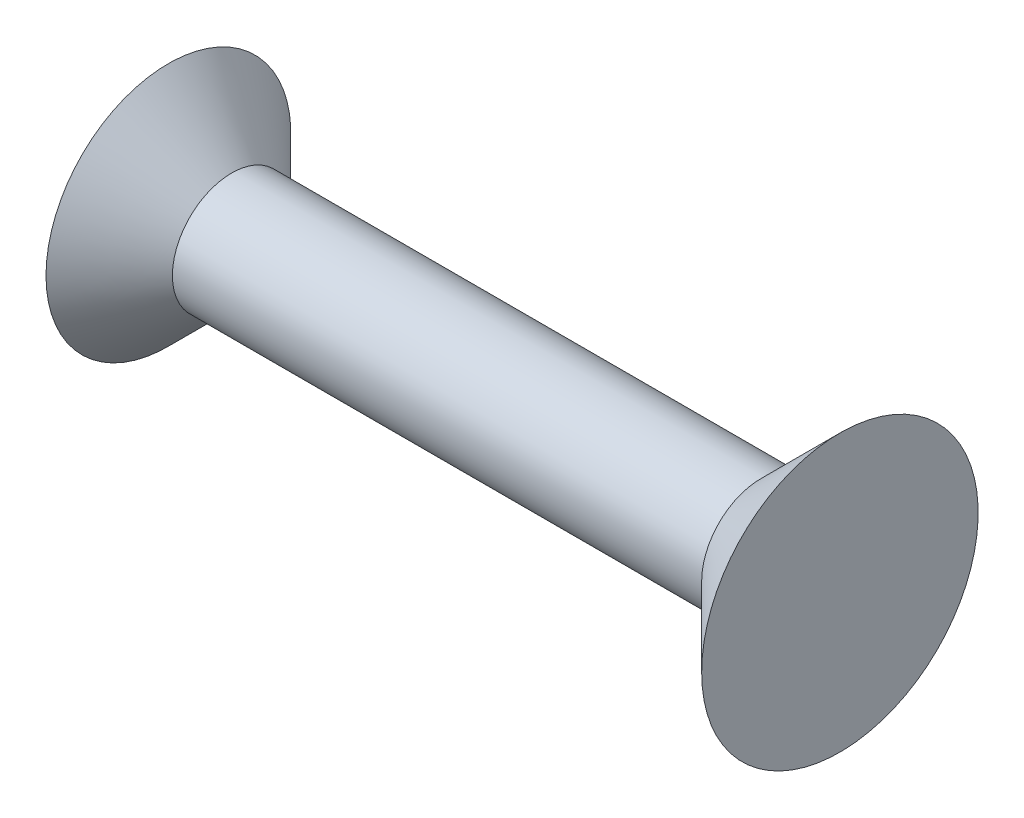
ISO-10303-21;
HEADER;
FILE_DESCRIPTION(('STEP AP214'),'2;1');
FILE_NAME('part.step','',(''),(''),'','','');
FILE_SCHEMA(('AUTOMOTIVE_DESIGN { 1 0 10303 214 1 1 1 1 }'));
ENDSEC;
DATA;
#1=APPLICATION_CONTEXT('core data for automotive mechanical design processes');
#2=APPLICATION_PROTOCOL_DEFINITION('international standard','automotive_design',2000,#1);
#3=PRODUCT_CONTEXT('',#1,'mechanical');
#4=PRODUCT('Part','Part','',(#3));
#5=PRODUCT_RELATED_PRODUCT_CATEGORY('part','',(#4));
#6=PRODUCT_DEFINITION_FORMATION('','',#4);
#7=PRODUCT_DEFINITION_CONTEXT('part definition',#1,'design');
#8=PRODUCT_DEFINITION('design','',#6,#7);
#9=PRODUCT_DEFINITION_SHAPE('','',#8);
#10=(LENGTH_UNIT() NAMED_UNIT(*) SI_UNIT(.MILLI.,.METRE.));
#11=(NAMED_UNIT(*) PLANE_ANGLE_UNIT() SI_UNIT($,.RADIAN.));
#12=(NAMED_UNIT(*) SI_UNIT($,.STERADIAN.) SOLID_ANGLE_UNIT());
#13=UNCERTAINTY_MEASURE_WITH_UNIT(LENGTH_MEASURE(1.E-05),#10,'distance_accuracy_value','');
#14=(GEOMETRIC_REPRESENTATION_CONTEXT(3) GLOBAL_UNCERTAINTY_ASSIGNED_CONTEXT((#13)) GLOBAL_UNIT_ASSIGNED_CONTEXT((#10,
#11,#12)) REPRESENTATION_CONTEXT('',''));
#15=CARTESIAN_POINT('',(0.,0.,0.));
#16=DIRECTION('',(0.,0.,1.));
#17=DIRECTION('',(1.,0.,0.));
#18=AXIS2_PLACEMENT_3D('',#15,#16,#17);
#19=CARTESIAN_POINT('',(0.,0.,0.));
#20=DIRECTION('',(-1.,0.,0.));
#21=DIRECTION('',(0.,0.,1.));
#22=AXIS2_PLACEMENT_3D('',#19,#20,#21);
#23=PLANE('',#22);
#24=CARTESIAN_POINT('',(0.,0.,0.));
#25=DIRECTION('',(-1.,0.,0.));
#26=DIRECTION('',(0.,0.,1.));
#27=AXIS2_PLACEMENT_3D('',#24,#25,#26);
#28=CIRCLE('',#27,3.50000000000001);
#29=CARTESIAN_POINT('',(0.,0.,3.50000000000001));
#30=VERTEX_POINT('',#29);
#31=EDGE_CURVE('E10',#30,#30,#28,.T.);
#32=ORIENTED_EDGE('',*,*,#31,.F.);
#33=EDGE_LOOP('',(#32));
#34=FACE_BOUND('',#33,.T.);
#35=ADVANCED_FACE('F24',(#34),#23,.F.);
#36=CARTESIAN_POINT('',(0.,0.,0.));
#37=DIRECTION('',(1.,0.,0.));
#38=DIRECTION('',(0.,0.,-1.));
#39=AXIS2_PLACEMENT_3D('',#36,#37,#38);
#40=CONICAL_SURFACE('',#39,3.50000000000001,0.78539816339745);
#41=CARTESIAN_POINT('',(-2.,0.,0.));
#42=DIRECTION('',(-1.,0.,0.));
#43=DIRECTION('',(0.,0.,1.));
#44=AXIS2_PLACEMENT_3D('',#41,#42,#43);
#45=CIRCLE('',#44,1.5);
#46=CARTESIAN_POINT('',(-2.,0.,1.5));
#47=VERTEX_POINT('',#46);
#48=EDGE_CURVE('E30',#47,#47,#45,.T.);
#49=ORIENTED_EDGE('',*,*,#48,.F.);
#50=EDGE_LOOP('',(#49));
#51=FACE_BOUND('',#50,.T.);
#52=ORIENTED_EDGE('',*,*,#31,.T.);
#53=EDGE_LOOP('',(#52));
#54=FACE_BOUND('',#53,.T.);
#55=ADVANCED_FACE('F54',(#51,#54),#40,.T.);
#56=CARTESIAN_POINT('',(0.,0.,0.));
#57=DIRECTION('',(-1.,0.,0.));
#58=DIRECTION('',(0.,0.,1.));
#59=AXIS2_PLACEMENT_3D('',#56,#57,#58);
#60=CYLINDRICAL_SURFACE('',#59,1.5);
#61=CARTESIAN_POINT('',(-15.4,0.,0.));
#62=DIRECTION('',(-1.,0.,0.));
#63=DIRECTION('',(0.,0.,1.));
#64=AXIS2_PLACEMENT_3D('',#61,#62,#63);
#65=CIRCLE('',#64,1.5);
#66=CARTESIAN_POINT('',(-15.4,0.,1.5));
#67=VERTEX_POINT('',#66);
#68=EDGE_CURVE('E34',#67,#67,#65,.T.);
#69=ORIENTED_EDGE('',*,*,#68,.F.);
#70=EDGE_LOOP('',(#69));
#71=FACE_BOUND('',#70,.T.);
#72=ORIENTED_EDGE('',*,*,#48,.T.);
#73=EDGE_LOOP('',(#72));
#74=FACE_BOUND('',#73,.T.);
#75=ADVANCED_FACE('F49',(#71,#74),#60,.T.);
#76=CARTESIAN_POINT('',(-15.4,0.,0.));
#77=DIRECTION('',(-1.,0.,0.));
#78=DIRECTION('',(0.,0.,1.));
#79=AXIS2_PLACEMENT_3D('',#76,#77,#78);
#80=CONICAL_SURFACE('',#79,1.5,0.78539816339745);
#81=CARTESIAN_POINT('',(-17.,0.,0.));
#82=DIRECTION('',(-1.,0.,0.));
#83=DIRECTION('',(0.,0.,1.));
#84=AXIS2_PLACEMENT_3D('',#81,#82,#83);
#85=CIRCLE('',#84,3.1);
#86=CARTESIAN_POINT('',(-17.,0.,3.1));
#87=VERTEX_POINT('',#86);
#88=EDGE_CURVE('E38',#87,#87,#85,.T.);
#89=ORIENTED_EDGE('',*,*,#88,.F.);
#90=EDGE_LOOP('',(#89));
#91=FACE_BOUND('',#90,.T.);
#92=ORIENTED_EDGE('',*,*,#68,.T.);
#93=EDGE_LOOP('',(#92));
#94=FACE_BOUND('',#93,.T.);
#95=ADVANCED_FACE('F46',(#91,#94),#80,.T.);
#96=CARTESIAN_POINT('',(-17.,3.1,0.));
#97=DIRECTION('',(1.,0.,0.));
#98=DIRECTION('',(0.,0.,-1.));
#99=AXIS2_PLACEMENT_3D('',#96,#97,#98);
#100=PLANE('',#99);
#101=ORIENTED_EDGE('',*,*,#88,.T.);
#102=EDGE_LOOP('',(#101));
#103=FACE_BOUND('',#102,.T.);
#104=ADVANCED_FACE('F44',(#103),#100,.F.);
#105=CLOSED_SHELL('',(#35,#55,#75,#95,#104));
#106=MANIFOLD_SOLID_BREP('B2',#105);
#107=ADVANCED_BREP_SHAPE_REPRESENTATION('',(#18,#106),#14);
#108=SHAPE_DEFINITION_REPRESENTATION(#9,#107);
ENDSEC;
END-ISO-10303-21;
